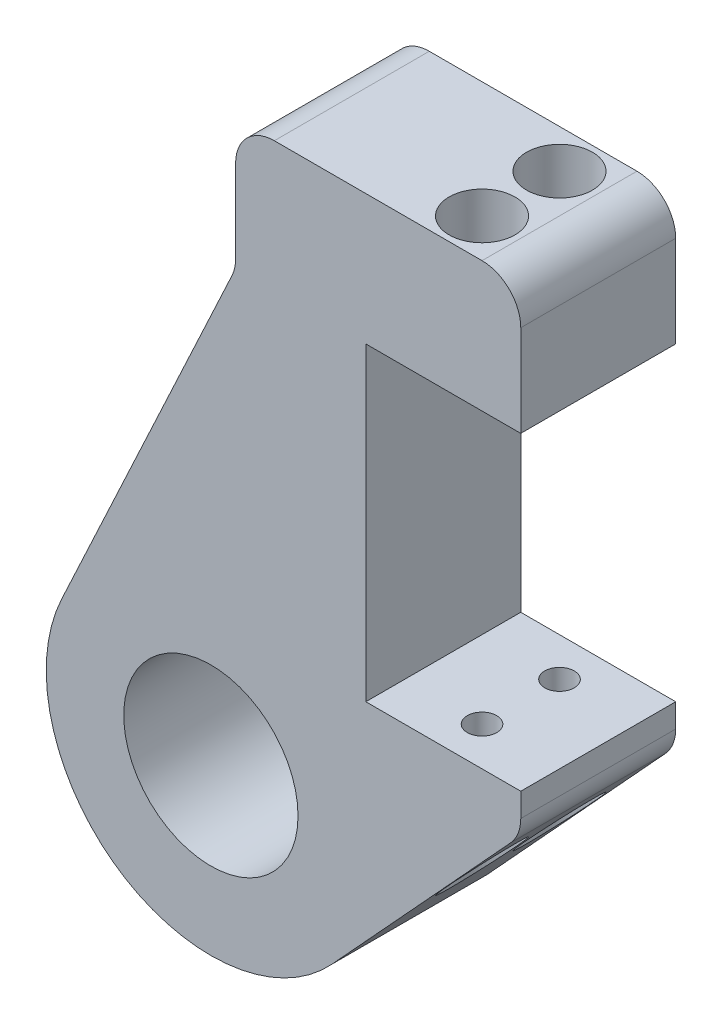
ISO-10303-21;
HEADER;
FILE_DESCRIPTION(('STEP AP214'),'2;1');
FILE_NAME('part.step','',(''),(''),'','','');
FILE_SCHEMA(('AUTOMOTIVE_DESIGN { 1 0 10303 214 1 1 1 1 }'));
ENDSEC;
DATA;
#1=APPLICATION_CONTEXT('core data for automotive mechanical design processes');
#2=APPLICATION_PROTOCOL_DEFINITION('international standard','automotive_design',2000,#1);
#3=PRODUCT_CONTEXT('',#1,'mechanical');
#4=PRODUCT('Part','Part','',(#3));
#5=PRODUCT_RELATED_PRODUCT_CATEGORY('part','',(#4));
#6=PRODUCT_DEFINITION_FORMATION('','',#4);
#7=PRODUCT_DEFINITION_CONTEXT('part definition',#1,'design');
#8=PRODUCT_DEFINITION('design','',#6,#7);
#9=PRODUCT_DEFINITION_SHAPE('','',#8);
#10=(LENGTH_UNIT() NAMED_UNIT(*) SI_UNIT(.MILLI.,.METRE.));
#11=(NAMED_UNIT(*) PLANE_ANGLE_UNIT() SI_UNIT($,.RADIAN.));
#12=(NAMED_UNIT(*) SI_UNIT($,.STERADIAN.) SOLID_ANGLE_UNIT());
#13=UNCERTAINTY_MEASURE_WITH_UNIT(LENGTH_MEASURE(1.E-05),#10,'distance_accuracy_value','');
#14=(GEOMETRIC_REPRESENTATION_CONTEXT(3) GLOBAL_UNCERTAINTY_ASSIGNED_CONTEXT((#13)) GLOBAL_UNIT_ASSIGNED_CONTEXT((#10,
#11,#12)) REPRESENTATION_CONTEXT('',''));
#15=CARTESIAN_POINT('',(0.,0.,0.));
#16=DIRECTION('',(0.,0.,1.));
#17=DIRECTION('',(1.,0.,0.));
#18=AXIS2_PLACEMENT_3D('',#15,#16,#17);
#19=CARTESIAN_POINT('',(-15.8749999999998,-66.7639585918251,812.800000000017));
#20=DIRECTION('',(0.,-1.,0.));
#21=DIRECTION('',(0.,0.,-1.));
#22=AXIS2_PLACEMENT_3D('',#19,#20,#21);
#23=CYLINDRICAL_SURFACE('',#22,2.413);
#24=CARTESIAN_POINT('',(-15.8749999999998,-138.911947917228,812.800000000017));
#25=DIRECTION('',(0.,-1.,0.));
#26=DIRECTION('',(0.,0.,-1.));
#27=AXIS2_PLACEMENT_3D('',#24,#25,#26);
#28=CIRCLE('',#27,2.413);
#29=CARTESIAN_POINT('',(-15.8749999999998,-138.911947917228,810.387000000017));
#30=VERTEX_POINT('',#29);
#31=EDGE_CURVE('E229',#30,#30,#28,.T.);
#32=ORIENTED_EDGE('',*,*,#31,.F.);
#33=EDGE_LOOP('',(#32));
#34=FACE_BOUND('',#33,.T.);
#35=CARTESIAN_POINT('',(-15.8749999999998,-151.611947917228,812.800000000017));
#36=DIRECTION('',(0.,-1.,0.));
#37=DIRECTION('',(0.,0.,-1.));
#38=AXIS2_PLACEMENT_3D('',#35,#36,#37);
#39=CIRCLE('',#38,2.413);
#40=CARTESIAN_POINT('',(-15.8749999999998,-151.611947917228,810.387000000017));
#41=VERTEX_POINT('',#40);
#42=EDGE_CURVE('E236',#41,#41,#39,.F.);
#43=ORIENTED_EDGE('',*,*,#42,.F.);
#44=EDGE_LOOP('',(#43));
#45=FACE_BOUND('',#44,.T.);
#46=ADVANCED_FACE('F43',(#34,#45),#23,.F.);
#47=CARTESIAN_POINT('',(-15.8749999999998,-66.7639585918251,800.100000000017));
#48=DIRECTION('',(0.,-1.,0.));
#49=DIRECTION('',(0.,0.,-1.));
#50=AXIS2_PLACEMENT_3D('',#47,#48,#49);
#51=CYLINDRICAL_SURFACE('',#50,2.413);
#52=CARTESIAN_POINT('',(-15.8749999999998,-138.911947917228,800.100000000017));
#53=DIRECTION('',(0.,-1.,0.));
#54=DIRECTION('',(0.,0.,-1.));
#55=AXIS2_PLACEMENT_3D('',#52,#53,#54);
#56=CIRCLE('',#55,2.413);
#57=CARTESIAN_POINT('',(-15.8749999999998,-138.911947917228,797.687000000017));
#58=VERTEX_POINT('',#57);
#59=EDGE_CURVE('E216',#58,#58,#56,.T.);
#60=ORIENTED_EDGE('',*,*,#59,.F.);
#61=EDGE_LOOP('',(#60));
#62=FACE_BOUND('',#61,.T.);
#63=CARTESIAN_POINT('',(-15.8749999999998,-151.611947917228,800.100000000017));
#64=DIRECTION('',(0.,-1.,0.));
#65=DIRECTION('',(0.,0.,-1.));
#66=AXIS2_PLACEMENT_3D('',#63,#64,#65);
#67=CIRCLE('',#66,2.413);
#68=CARTESIAN_POINT('',(-15.8749999999998,-151.611947917228,797.687000000017));
#69=VERTEX_POINT('',#68);
#70=EDGE_CURVE('E228',#69,#69,#67,.F.);
#71=ORIENTED_EDGE('',*,*,#70,.F.);
#72=EDGE_LOOP('',(#71));
#73=FACE_BOUND('',#72,.T.);
#74=ADVANCED_FACE('F281',(#62,#73),#51,.F.);
#75=CARTESIAN_POINT('',(-53.9750000000132,-160.659378076237,819.150000000017));
#76=DIRECTION('',(0.,0.,1.));
#77=DIRECTION('',(1.,0.,0.));
#78=AXIS2_PLACEMENT_3D('',#75,#76,#77);
#79=PLANE('',#78);
#80=DIRECTION('',(0.676619609693961,0.736332739851755,0.));
#81=VECTOR('',#80,1.);
#82=CARTESIAN_POINT('',(-34.1032201832639,-178.919649792853,819.150000000017));
#83=LINE('',#82,#81);
#84=CARTESIAN_POINT('',(-34.1032201832639,-178.919649792853,819.150000000017));
#85=VERTEX_POINT('',#84);
#86=CARTESIAN_POINT('',(-4.84928710194112,-147.083994442939,819.150000000017));
#87=VERTEX_POINT('',#86);
#88=EDGE_CURVE('E170',#85,#87,#83,.T.);
#89=ORIENTED_EDGE('',*,*,#88,.T.);
#90=CARTESIAN_POINT('',(-9.52499999999979,-142.787459921382,819.150000000017));
#91=DIRECTION('',(0.,0.,1.));
#92=DIRECTION('',(1.,0.,0.));
#93=AXIS2_PLACEMENT_3D('',#90,#91,#92);
#94=CIRCLE('',#93,6.35);
#95=CARTESIAN_POINT('',(-3.17499999999979,-142.787459921382,819.150000000017));
#96=VERTEX_POINT('',#95);
#97=EDGE_CURVE('E252',#87,#96,#94,.T.);
#98=ORIENTED_EDGE('',*,*,#97,.T.);
#99=DIRECTION('',(0.,1.,0.));
#100=VECTOR('',#99,1.);
#101=CARTESIAN_POINT('',(-3.17499999999979,-138.911947917228,819.150000000017));
#102=LINE('',#101,#100);
#103=CARTESIAN_POINT('',(-3.17499999999979,-138.911947917228,819.150000000017));
#104=VERTEX_POINT('',#103);
#105=EDGE_CURVE('E169',#96,#104,#102,.T.);
#106=ORIENTED_EDGE('',*,*,#105,.T.);
#107=DIRECTION('',(-1.,0.,0.));
#108=VECTOR('',#107,1.);
#109=CARTESIAN_POINT('',(-3.17499999999979,-138.911947917228,819.150000000017));
#110=LINE('',#109,#108);
#111=CARTESIAN_POINT('',(-28.5749999999998,-138.911947917228,819.150000000017));
#112=VERTEX_POINT('',#111);
#113=EDGE_CURVE('E172',#104,#112,#110,.T.);
#114=ORIENTED_EDGE('',*,*,#113,.T.);
#115=DIRECTION('',(0.,1.,0.));
#116=VECTOR('',#115,1.);
#117=CARTESIAN_POINT('',(-28.5749999999998,-88.1119479172279,819.150000000017));
#118=LINE('',#117,#116);
#119=CARTESIAN_POINT('',(-28.5749999999998,-88.1119479172279,819.150000000017));
#120=VERTEX_POINT('',#119);
#121=EDGE_CURVE('E176',#112,#120,#118,.T.);
#122=ORIENTED_EDGE('',*,*,#121,.T.);
#123=DIRECTION('',(1.,0.,0.));
#124=VECTOR('',#123,1.);
#125=CARTESIAN_POINT('',(-28.5749999999998,-88.1119479172279,819.150000000017));
#126=LINE('',#125,#124);
#127=CARTESIAN_POINT('',(-3.17499999999979,-88.1119479172279,819.150000000017));
#128=VERTEX_POINT('',#127);
#129=EDGE_CURVE('E178',#120,#128,#126,.T.);
#130=ORIENTED_EDGE('',*,*,#129,.T.);
#131=DIRECTION('',(0.,1.,0.));
#132=VECTOR('',#131,1.);
#133=CARTESIAN_POINT('',(-3.17499999999979,-88.1119479172279,819.150000000017));
#134=LINE('',#133,#132);
#135=CARTESIAN_POINT('',(-3.17499999999979,-73.1139585918251,819.150000000017));
#136=VERTEX_POINT('',#135);
#137=EDGE_CURVE('E204',#128,#136,#134,.T.);
#138=ORIENTED_EDGE('',*,*,#137,.T.);
#139=CARTESIAN_POINT('',(-9.52499999999979,-73.1139585918251,819.150000000017));
#140=DIRECTION('',(0.,0.,1.));
#141=DIRECTION('',(1.,0.,0.));
#142=AXIS2_PLACEMENT_3D('',#139,#140,#141);
#143=CIRCLE('',#142,6.35);
#144=CARTESIAN_POINT('',(-9.52499999999979,-66.7639585918251,819.150000000017));
#145=VERTEX_POINT('',#144);
#146=EDGE_CURVE('E248',#136,#145,#143,.T.);
#147=ORIENTED_EDGE('',*,*,#146,.T.);
#148=DIRECTION('',(-1.,0.,0.));
#149=VECTOR('',#148,1.);
#150=CARTESIAN_POINT('',(-3.17499999999979,-66.7639585918251,819.150000000017));
#151=LINE('',#150,#149);
#152=CARTESIAN_POINT('',(-43.5729893254026,-66.7639585918251,819.150000000017));
#153=VERTEX_POINT('',#152);
#154=EDGE_CURVE('E343',#145,#153,#151,.T.);
#155=ORIENTED_EDGE('',*,*,#154,.T.);
#156=CARTESIAN_POINT('',(-43.5729893254026,-73.1139585918251,819.150000000017));
#157=DIRECTION('',(0.,0.,1.));
#158=DIRECTION('',(1.,0.,0.));
#159=AXIS2_PLACEMENT_3D('',#156,#157,#158);
#160=CIRCLE('',#159,6.35);
#161=CARTESIAN_POINT('',(-49.9229893254026,-73.1139585918251,819.150000000017));
#162=VERTEX_POINT('',#161);
#163=EDGE_CURVE('E250',#153,#162,#160,.T.);
#164=ORIENTED_EDGE('',*,*,#163,.T.);
#165=DIRECTION('',(0.,-1.,0.));
#166=VECTOR('',#165,1.);
#167=CARTESIAN_POINT('',(-49.9229893254026,-88.1119479172279,819.150000000017));
#168=LINE('',#167,#166);
#169=CARTESIAN_POINT('',(-49.9229893254026,-86.7041868094452,819.150000000017));
#170=VERTEX_POINT('',#169);
#171=EDGE_CURVE('E154',#162,#170,#168,.T.);
#172=ORIENTED_EDGE('',*,*,#171,.T.);
#173=CARTESIAN_POINT('',(-56.2729893254026,-86.7041868094452,819.150000000017));
#174=DIRECTION('',(0.,0.,1.));
#175=DIRECTION('',(1.,0.,0.));
#176=AXIS2_PLACEMENT_3D('',#173,#174,#175);
#177=CIRCLE('',#176,6.35);
#178=CARTESIAN_POINT('',(-50.5179348777199,-89.3878127714986,819.150000000017));
#179=VERTEX_POINT('',#178);
#180=EDGE_CURVE('E12',#170,#179,#177,.F.);
#181=ORIENTED_EDGE('',*,*,#180,.T.);
#182=DIRECTION('',(-0.422618261740697,-0.906307787036651,0.));
#183=VECTOR('',#182,1.);
#184=CARTESIAN_POINT('',(-49.9229893254026,-88.1119479172279,819.150000000017));
#185=LINE('',#184,#183);
#186=CARTESIAN_POINT('',(-78.4339814026648,-149.25396773751,819.150000000017));
#187=VERTEX_POINT('',#186);
#188=EDGE_CURVE('E142',#179,#187,#185,.T.);
#189=ORIENTED_EDGE('',*,*,#188,.T.);
#190=CARTESIAN_POINT('',(-53.9750000000132,-160.659378076237,819.150000000017));
#191=DIRECTION('',(0.,0.,1.));
#192=DIRECTION('',(1.,0.,0.));
#193=AXIS2_PLACEMENT_3D('',#190,#191,#192);
#194=CIRCLE('',#193,26.9875);
#195=EDGE_CURVE('E150',#187,#85,#194,.T.);
#196=ORIENTED_EDGE('',*,*,#195,.T.);
#197=EDGE_LOOP('',(#89,#98,#106,#114,#122,#130,#138,#147,#155,#164,#172,#181,#189,#196));
#198=FACE_BOUND('',#197,.T.);
#199=CARTESIAN_POINT('',(-53.9750000000132,-160.659378076237,819.150000000017));
#200=DIRECTION('',(0.,0.,1.));
#201=DIRECTION('',(1.,0.,0.));
#202=AXIS2_PLACEMENT_3D('',#199,#200,#201);
#203=CIRCLE('',#202,14.287500000011);
#204=CARTESIAN_POINT('',(-39.6875000000021,-160.659378076237,819.150000000017));
#205=VERTEX_POINT('',#204);
#206=EDGE_CURVE('E184',#205,#205,#203,.T.);
#207=ORIENTED_EDGE('',*,*,#206,.F.);
#208=EDGE_LOOP('',(#207));
#209=FACE_BOUND('',#208,.T.);
#210=ADVANCED_FACE('F144',(#198,#209),#79,.T.);
#211=CARTESIAN_POINT('',(-53.9750000000132,-160.659378076237,793.750000000017));
#212=DIRECTION('',(0.,0.,1.));
#213=DIRECTION('',(1.,0.,0.));
#214=AXIS2_PLACEMENT_3D('',#211,#212,#213);
#215=PLANE('',#214);
#216=DIRECTION('',(0.,1.,0.));
#217=VECTOR('',#216,1.);
#218=CARTESIAN_POINT('',(-3.17499999999979,-138.911947917228,793.750000000017));
#219=LINE('',#218,#217);
#220=CARTESIAN_POINT('',(-3.17499999999979,-142.787459921382,793.750000000017));
#221=VERTEX_POINT('',#220);
#222=CARTESIAN_POINT('',(-3.17499999999979,-138.911947917228,793.750000000017));
#223=VERTEX_POINT('',#222);
#224=EDGE_CURVE('E198',#221,#223,#219,.T.);
#225=ORIENTED_EDGE('',*,*,#224,.F.);
#226=CARTESIAN_POINT('',(-9.52499999999979,-142.787459921382,793.750000000017));
#227=DIRECTION('',(0.,0.,1.));
#228=DIRECTION('',(1.,0.,0.));
#229=AXIS2_PLACEMENT_3D('',#226,#227,#228);
#230=CIRCLE('',#229,6.35);
#231=CARTESIAN_POINT('',(-4.84928710194112,-147.083994442939,793.750000000017));
#232=VERTEX_POINT('',#231);
#233=EDGE_CURVE('E243',#221,#232,#230,.F.);
#234=ORIENTED_EDGE('',*,*,#233,.T.);
#235=DIRECTION('',(0.676619609693961,0.736332739851755,0.));
#236=VECTOR('',#235,1.);
#237=CARTESIAN_POINT('',(-34.1032201832639,-178.919649792853,793.750000000017));
#238=LINE('',#237,#236);
#239=CARTESIAN_POINT('',(-34.1032201832639,-178.919649792853,793.750000000017));
#240=VERTEX_POINT('',#239);
#241=EDGE_CURVE('E192',#240,#232,#238,.T.);
#242=ORIENTED_EDGE('',*,*,#241,.F.);
#243=CARTESIAN_POINT('',(-53.9750000000132,-160.659378076237,793.750000000017));
#244=DIRECTION('',(0.,0.,1.));
#245=DIRECTION('',(1.,0.,0.));
#246=AXIS2_PLACEMENT_3D('',#243,#244,#245);
#247=CIRCLE('',#246,26.9875);
#248=CARTESIAN_POINT('',(-78.4339814026648,-149.25396773751,793.750000000017));
#249=VERTEX_POINT('',#248);
#250=EDGE_CURVE('E191',#249,#240,#247,.T.);
#251=ORIENTED_EDGE('',*,*,#250,.F.);
#252=DIRECTION('',(-0.422618261740697,-0.906307787036651,0.));
#253=VECTOR('',#252,1.);
#254=CARTESIAN_POINT('',(-49.9229893254026,-88.1119479172279,793.750000000017));
#255=LINE('',#254,#253);
#256=CARTESIAN_POINT('',(-50.5179348777199,-89.3878127714986,793.750000000017));
#257=VERTEX_POINT('',#256);
#258=EDGE_CURVE('E156',#257,#249,#255,.T.);
#259=ORIENTED_EDGE('',*,*,#258,.F.);
#260=CARTESIAN_POINT('',(-56.2729893254026,-86.7041868094452,793.750000000017));
#261=DIRECTION('',(0.,0.,1.));
#262=DIRECTION('',(1.,0.,0.));
#263=AXIS2_PLACEMENT_3D('',#260,#261,#262);
#264=CIRCLE('',#263,6.35);
#265=CARTESIAN_POINT('',(-49.9229893254026,-86.7041868094452,793.750000000017));
#266=VERTEX_POINT('',#265);
#267=EDGE_CURVE('E51',#257,#266,#264,.T.);
#268=ORIENTED_EDGE('',*,*,#267,.T.);
#269=DIRECTION('',(0.,-1.,0.));
#270=VECTOR('',#269,1.);
#271=CARTESIAN_POINT('',(-49.9229893254026,-88.1119479172279,793.750000000017));
#272=LINE('',#271,#270);
#273=CARTESIAN_POINT('',(-49.9229893254026,-73.1139585918251,793.750000000017));
#274=VERTEX_POINT('',#273);
#275=EDGE_CURVE('E189',#274,#266,#272,.T.);
#276=ORIENTED_EDGE('',*,*,#275,.F.);
#277=CARTESIAN_POINT('',(-43.5729893254026,-73.1139585918251,793.750000000017));
#278=DIRECTION('',(0.,0.,1.));
#279=DIRECTION('',(1.,0.,0.));
#280=AXIS2_PLACEMENT_3D('',#277,#278,#279);
#281=CIRCLE('',#280,6.35);
#282=CARTESIAN_POINT('',(-43.5729893254026,-66.7639585918251,793.750000000017));
#283=VERTEX_POINT('',#282);
#284=EDGE_CURVE('E237',#274,#283,#281,.F.);
#285=ORIENTED_EDGE('',*,*,#284,.T.);
#286=DIRECTION('',(-1.,0.,0.));
#287=VECTOR('',#286,1.);
#288=CARTESIAN_POINT('',(-3.17499999999979,-66.7639585918251,793.750000000017));
#289=LINE('',#288,#287);
#290=CARTESIAN_POINT('',(-9.52499999999979,-66.7639585918251,793.750000000017));
#291=VERTEX_POINT('',#290);
#292=EDGE_CURVE('E183',#291,#283,#289,.T.);
#293=ORIENTED_EDGE('',*,*,#292,.F.);
#294=CARTESIAN_POINT('',(-9.52499999999979,-73.1139585918251,793.750000000017));
#295=DIRECTION('',(0.,0.,1.));
#296=DIRECTION('',(1.,0.,0.));
#297=AXIS2_PLACEMENT_3D('',#294,#295,#296);
#298=CIRCLE('',#297,6.35);
#299=CARTESIAN_POINT('',(-3.17499999999979,-73.1139585918251,793.750000000017));
#300=VERTEX_POINT('',#299);
#301=EDGE_CURVE('E241',#291,#300,#298,.F.);
#302=ORIENTED_EDGE('',*,*,#301,.T.);
#303=DIRECTION('',(0.,1.,0.));
#304=VECTOR('',#303,1.);
#305=CARTESIAN_POINT('',(-3.17499999999979,-88.1119479172279,793.750000000017));
#306=LINE('',#305,#304);
#307=CARTESIAN_POINT('',(-3.17499999999979,-88.1119479172279,793.750000000017));
#308=VERTEX_POINT('',#307);
#309=EDGE_CURVE('E181',#308,#300,#306,.T.);
#310=ORIENTED_EDGE('',*,*,#309,.F.);
#311=DIRECTION('',(1.,0.,0.));
#312=VECTOR('',#311,1.);
#313=CARTESIAN_POINT('',(-28.5749999999998,-88.1119479172279,793.750000000017));
#314=LINE('',#313,#312);
#315=CARTESIAN_POINT('',(-28.5749999999998,-88.1119479172279,793.750000000017));
#316=VERTEX_POINT('',#315);
#317=EDGE_CURVE('E205',#316,#308,#314,.T.);
#318=ORIENTED_EDGE('',*,*,#317,.F.);
#319=DIRECTION('',(0.,1.,0.));
#320=VECTOR('',#319,1.);
#321=CARTESIAN_POINT('',(-28.5749999999998,-88.1119479172279,793.750000000017));
#322=LINE('',#321,#320);
#323=CARTESIAN_POINT('',(-28.5749999999998,-138.911947917228,793.750000000017));
#324=VERTEX_POINT('',#323);
#325=EDGE_CURVE('E196',#324,#316,#322,.T.);
#326=ORIENTED_EDGE('',*,*,#325,.F.);
#327=DIRECTION('',(-1.,0.,0.));
#328=VECTOR('',#327,1.);
#329=CARTESIAN_POINT('',(-3.17499999999979,-138.911947917228,793.750000000017));
#330=LINE('',#329,#328);
#331=EDGE_CURVE('E197',#223,#324,#330,.T.);
#332=ORIENTED_EDGE('',*,*,#331,.F.);
#333=EDGE_LOOP('',(#225,#234,#242,#251,#259,#268,#276,#285,#293,#302,#310,#318,#326,#332));
#334=FACE_BOUND('',#333,.T.);
#335=CARTESIAN_POINT('',(-53.9750000000132,-160.659378076237,793.750000000017));
#336=DIRECTION('',(0.,0.,1.));
#337=DIRECTION('',(1.,0.,0.));
#338=AXIS2_PLACEMENT_3D('',#335,#336,#337);
#339=CIRCLE('',#338,14.287500000011);
#340=CARTESIAN_POINT('',(-39.6875000000021,-160.659378076237,793.750000000017));
#341=VERTEX_POINT('',#340);
#342=EDGE_CURVE('E350',#341,#341,#339,.T.);
#343=ORIENTED_EDGE('',*,*,#342,.T.);
#344=EDGE_LOOP('',(#343));
#345=FACE_BOUND('',#344,.T.);
#346=ADVANCED_FACE('F266',(#334,#345),#215,.F.);
#347=CARTESIAN_POINT('',(-3.17499999999979,-88.1119479172279,819.150000000017));
#348=DIRECTION('',(-1.,0.,0.));
#349=DIRECTION('',(0.,0.,1.));
#350=AXIS2_PLACEMENT_3D('',#347,#348,#349);
#351=PLANE('',#350);
#352=ORIENTED_EDGE('',*,*,#309,.T.);
#353=DIRECTION('',(0.,0.,-1.));
#354=VECTOR('',#353,1.);
#355=CARTESIAN_POINT('',(-3.17499999999979,-73.1139585918251,819.150000000017));
#356=LINE('',#355,#354);
#357=EDGE_CURVE('E257',#300,#136,#356,.F.);
#358=ORIENTED_EDGE('',*,*,#357,.T.);
#359=ORIENTED_EDGE('',*,*,#137,.F.);
#360=DIRECTION('',(0.,0.,-1.));
#361=VECTOR('',#360,1.);
#362=CARTESIAN_POINT('',(-3.17499999999979,-88.1119479172279,819.150000000017));
#363=LINE('',#362,#361);
#364=EDGE_CURVE('E179',#128,#308,#363,.T.);
#365=ORIENTED_EDGE('',*,*,#364,.T.);
#366=EDGE_LOOP('',(#352,#358,#359,#365));
#367=FACE_BOUND('',#366,.T.);
#368=ADVANCED_FACE('F331',(#367),#351,.F.);
#369=CARTESIAN_POINT('',(-3.17499999999979,-66.7639585918251,819.150000000017));
#370=DIRECTION('',(0.,-1.,0.));
#371=DIRECTION('',(0.,0.,-1.));
#372=AXIS2_PLACEMENT_3D('',#369,#370,#371);
#373=PLANE('',#372);
#374=CARTESIAN_POINT('',(-15.8749999999998,-66.7639585918251,812.800000000017));
#375=DIRECTION('',(0.,-1.,0.));
#376=DIRECTION('',(0.,0.,-1.));
#377=AXIS2_PLACEMENT_3D('',#374,#375,#376);
#378=CIRCLE('',#377,5.39749999999999);
#379=CARTESIAN_POINT('',(-15.8749999999998,-66.7639585918251,807.402500000017));
#380=VERTEX_POINT('',#379);
#381=EDGE_CURVE('E233',#380,#380,#378,.T.);
#382=ORIENTED_EDGE('',*,*,#381,.T.);
#383=EDGE_LOOP('',(#382));
#384=FACE_BOUND('',#383,.T.);
#385=CARTESIAN_POINT('',(-15.8749999999998,-66.7639585918251,800.100000000017));
#386=DIRECTION('',(0.,-1.,0.));
#387=DIRECTION('',(0.,0.,-1.));
#388=AXIS2_PLACEMENT_3D('',#385,#386,#387);
#389=CIRCLE('',#388,5.39749999999999);
#390=CARTESIAN_POINT('',(-15.8749999999998,-66.7639585918251,794.702500000017));
#391=VERTEX_POINT('',#390);
#392=EDGE_CURVE('E223',#391,#391,#389,.T.);
#393=ORIENTED_EDGE('',*,*,#392,.T.);
#394=EDGE_LOOP('',(#393));
#395=FACE_BOUND('',#394,.T.);
#396=ORIENTED_EDGE('',*,*,#154,.F.);
#397=DIRECTION('',(0.,0.,-1.));
#398=VECTOR('',#397,1.);
#399=CARTESIAN_POINT('',(-9.52499999999979,-66.7639585918251,819.150000000017));
#400=LINE('',#399,#398);
#401=EDGE_CURVE('E253',#145,#291,#400,.T.);
#402=ORIENTED_EDGE('',*,*,#401,.T.);
#403=ORIENTED_EDGE('',*,*,#292,.T.);
#404=DIRECTION('',(0.,0.,-1.));
#405=VECTOR('',#404,1.);
#406=CARTESIAN_POINT('',(-43.5729893254026,-66.7639585918251,819.150000000017));
#407=LINE('',#406,#405);
#408=EDGE_CURVE('E254',#283,#153,#407,.F.);
#409=ORIENTED_EDGE('',*,*,#408,.T.);
#410=EDGE_LOOP('',(#396,#402,#403,#409));
#411=FACE_BOUND('',#410,.T.);
#412=ADVANCED_FACE('F341',(#384,#395,#411),#373,.F.);
#413=CARTESIAN_POINT('',(-49.9229893254026,-88.1119479172279,819.150000000017));
#414=DIRECTION('',(1.,0.,0.));
#415=DIRECTION('',(0.,1.,0.));
#416=AXIS2_PLACEMENT_3D('',#413,#414,#415);
#417=PLANE('',#416);
#418=ORIENTED_EDGE('',*,*,#275,.T.);
#419=DIRECTION('',(0.,0.,-1.));
#420=VECTOR('',#419,1.);
#421=CARTESIAN_POINT('',(-49.9229893254026,-86.7041868094452,819.150000000017));
#422=LINE('',#421,#420);
#423=EDGE_CURVE('E63',#266,#170,#422,.F.);
#424=ORIENTED_EDGE('',*,*,#423,.T.);
#425=ORIENTED_EDGE('',*,*,#171,.F.);
#426=DIRECTION('',(0.,0.,-1.));
#427=VECTOR('',#426,1.);
#428=CARTESIAN_POINT('',(-49.9229893254026,-73.1139585918251,819.150000000017));
#429=LINE('',#428,#427);
#430=EDGE_CURVE('E264',#162,#274,#429,.T.);
#431=ORIENTED_EDGE('',*,*,#430,.T.);
#432=EDGE_LOOP('',(#418,#424,#425,#431));
#433=FACE_BOUND('',#432,.T.);
#434=ADVANCED_FACE('F272',(#433),#417,.F.);
#435=CARTESIAN_POINT('',(-49.9229893254026,-88.1119479172279,819.150000000017));
#436=DIRECTION('',(0.906307787036651,-0.422618261740697,0.));
#437=DIRECTION('',(0.422618261740697,0.906307787036651,0.));
#438=AXIS2_PLACEMENT_3D('',#435,#436,#437);
#439=PLANE('',#438);
#440=ORIENTED_EDGE('',*,*,#188,.F.);
#441=DIRECTION('',(0.,0.,-1.));
#442=VECTOR('',#441,1.);
#443=CARTESIAN_POINT('',(-50.5179348777199,-89.3878127714986,793.750000000017));
#444=LINE('',#443,#442);
#445=EDGE_CURVE('E259',#179,#257,#444,.T.);
#446=ORIENTED_EDGE('',*,*,#445,.T.);
#447=ORIENTED_EDGE('',*,*,#258,.T.);
#448=DIRECTION('',(0.,0.,-1.));
#449=VECTOR('',#448,1.);
#450=CARTESIAN_POINT('',(-78.4339814026648,-149.25396773751,819.150000000017));
#451=LINE('',#450,#449);
#452=EDGE_CURVE('E151',#187,#249,#451,.T.);
#453=ORIENTED_EDGE('',*,*,#452,.F.);
#454=EDGE_LOOP('',(#440,#446,#447,#453));
#455=FACE_BOUND('',#454,.T.);
#456=ADVANCED_FACE('F158',(#455),#439,.F.);
#457=CARTESIAN_POINT('',(-53.9750000000132,-160.659378076237,819.150000000017));
#458=DIRECTION('',(0.,0.,-1.));
#459=DIRECTION('',(-1.,0.,0.));
#460=AXIS2_PLACEMENT_3D('',#457,#458,#459);
#461=CYLINDRICAL_SURFACE('',#460,26.9875);
#462=ORIENTED_EDGE('',*,*,#250,.T.);
#463=DIRECTION('',(0.,0.,-1.));
#464=VECTOR('',#463,1.);
#465=CARTESIAN_POINT('',(-34.1032201832639,-178.919649792853,819.150000000017));
#466=LINE('',#465,#464);
#467=EDGE_CURVE('E162',#85,#240,#466,.T.);
#468=ORIENTED_EDGE('',*,*,#467,.F.);
#469=ORIENTED_EDGE('',*,*,#195,.F.);
#470=ORIENTED_EDGE('',*,*,#452,.T.);
#471=EDGE_LOOP('',(#462,#468,#469,#470));
#472=FACE_BOUND('',#471,.T.);
#473=ADVANCED_FACE('F165',(#472),#461,.T.);
#474=CARTESIAN_POINT('',(-34.1032201832639,-178.919649792853,819.150000000017));
#475=DIRECTION('',(-0.736332739851755,0.676619609693961,0.));
#476=DIRECTION('',(-0.676619609693961,-0.736332739851755,0.));
#477=AXIS2_PLACEMENT_3D('',#474,#475,#476);
#478=PLANE('',#477);
#479=CARTESIAN_POINT('',(-15.8749999999998,-159.082750125942,812.800000000017));
#480=DIRECTION('',(-0.736332739851755,0.676619609693961,0.));
#481=DIRECTION('',(-0.676619609693961,-0.736332739851755,0.));
#482=AXIS2_PLACEMENT_3D('',#479,#480,#481);
#483=ELLIPSE('',#482,7.97715573517197,5.39749999999999);
#484=CARTESIAN_POINT('',(-21.2724999999998,-164.956591064645,812.800000000017));
#485=VERTEX_POINT('',#484);
#486=EDGE_CURVE('E235',#485,#485,#483,.T.);
#487=ORIENTED_EDGE('',*,*,#486,.T.);
#488=EDGE_LOOP('',(#487));
#489=FACE_BOUND('',#488,.T.);
#490=CARTESIAN_POINT('',(-15.8749999999998,-159.082750125942,800.100000000017));
#491=DIRECTION('',(-0.736332739851755,0.676619609693961,0.));
#492=DIRECTION('',(-0.676619609693961,-0.736332739851755,0.));
#493=AXIS2_PLACEMENT_3D('',#490,#491,#492);
#494=ELLIPSE('',#493,7.97715573517197,5.39749999999999);
#495=CARTESIAN_POINT('',(-21.2724999999998,-164.956591064645,800.100000000017));
#496=VERTEX_POINT('',#495);
#497=EDGE_CURVE('E225',#496,#496,#494,.T.);
#498=ORIENTED_EDGE('',*,*,#497,.T.);
#499=EDGE_LOOP('',(#498));
#500=FACE_BOUND('',#499,.T.);
#501=ORIENTED_EDGE('',*,*,#241,.T.);
#502=DIRECTION('',(0.,0.,-1.));
#503=VECTOR('',#502,1.);
#504=CARTESIAN_POINT('',(-4.84928710194113,-147.083994442939,819.150000000017));
#505=LINE('',#504,#503);
#506=EDGE_CURVE('E244',#232,#87,#505,.F.);
#507=ORIENTED_EDGE('',*,*,#506,.T.);
#508=ORIENTED_EDGE('',*,*,#88,.F.);
#509=ORIENTED_EDGE('',*,*,#467,.T.);
#510=EDGE_LOOP('',(#501,#507,#508,#509));
#511=FACE_BOUND('',#510,.T.);
#512=ADVANCED_FACE('F455',(#489,#500,#511),#478,.F.);
#513=CARTESIAN_POINT('',(-3.17499999999979,-138.911947917228,819.150000000017));
#514=DIRECTION('',(-1.,0.,0.));
#515=DIRECTION('',(0.,-1.,0.));
#516=AXIS2_PLACEMENT_3D('',#513,#514,#515);
#517=PLANE('',#516);
#518=ORIENTED_EDGE('',*,*,#105,.F.);
#519=DIRECTION('',(0.,0.,-1.));
#520=VECTOR('',#519,1.);
#521=CARTESIAN_POINT('',(-3.17499999999979,-142.787459921382,819.150000000017));
#522=LINE('',#521,#520);
#523=EDGE_CURVE('E163',#96,#221,#522,.T.);
#524=ORIENTED_EDGE('',*,*,#523,.T.);
#525=ORIENTED_EDGE('',*,*,#224,.T.);
#526=DIRECTION('',(0.,0.,-1.));
#527=VECTOR('',#526,1.);
#528=CARTESIAN_POINT('',(-3.17499999999979,-138.911947917228,819.150000000017));
#529=LINE('',#528,#527);
#530=EDGE_CURVE('E212',#104,#223,#529,.T.);
#531=ORIENTED_EDGE('',*,*,#530,.F.);
#532=EDGE_LOOP('',(#518,#524,#525,#531));
#533=FACE_BOUND('',#532,.T.);
#534=ADVANCED_FACE('F450',(#533),#517,.F.);
#535=CARTESIAN_POINT('',(-3.17499999999979,-138.911947917228,819.150000000017));
#536=DIRECTION('',(0.,-1.,0.));
#537=DIRECTION('',(0.,0.,-1.));
#538=AXIS2_PLACEMENT_3D('',#535,#536,#537);
#539=PLANE('',#538);
#540=ORIENTED_EDGE('',*,*,#31,.T.);
#541=EDGE_LOOP('',(#540));
#542=FACE_BOUND('',#541,.T.);
#543=ORIENTED_EDGE('',*,*,#59,.T.);
#544=EDGE_LOOP('',(#543));
#545=FACE_BOUND('',#544,.T.);
#546=ORIENTED_EDGE('',*,*,#331,.T.);
#547=DIRECTION('',(0.,0.,-1.));
#548=VECTOR('',#547,1.);
#549=CARTESIAN_POINT('',(-28.5749999999998,-138.911947917228,819.150000000017));
#550=LINE('',#549,#548);
#551=EDGE_CURVE('E208',#112,#324,#550,.T.);
#552=ORIENTED_EDGE('',*,*,#551,.F.);
#553=ORIENTED_EDGE('',*,*,#113,.F.);
#554=ORIENTED_EDGE('',*,*,#530,.T.);
#555=EDGE_LOOP('',(#546,#552,#553,#554));
#556=FACE_BOUND('',#555,.T.);
#557=ADVANCED_FACE('F451',(#542,#545,#556),#539,.F.);
#558=CARTESIAN_POINT('',(-28.5749999999998,-88.1119479172279,819.150000000017));
#559=DIRECTION('',(-1.,0.,0.));
#560=DIRECTION('',(0.,-1.,0.));
#561=AXIS2_PLACEMENT_3D('',#558,#559,#560);
#562=PLANE('',#561);
#563=ORIENTED_EDGE('',*,*,#325,.T.);
#564=DIRECTION('',(0.,0.,-1.));
#565=VECTOR('',#564,1.);
#566=CARTESIAN_POINT('',(-28.5749999999998,-88.1119479172279,819.150000000017));
#567=LINE('',#566,#565);
#568=EDGE_CURVE('E210',#120,#316,#567,.T.);
#569=ORIENTED_EDGE('',*,*,#568,.F.);
#570=ORIENTED_EDGE('',*,*,#121,.F.);
#571=ORIENTED_EDGE('',*,*,#551,.T.);
#572=EDGE_LOOP('',(#563,#569,#570,#571));
#573=FACE_BOUND('',#572,.T.);
#574=ADVANCED_FACE('F321',(#573),#562,.F.);
#575=CARTESIAN_POINT('',(-28.5749999999998,-88.1119479172279,819.150000000017));
#576=DIRECTION('',(0.,1.,0.));
#577=DIRECTION('',(0.,0.,1.));
#578=AXIS2_PLACEMENT_3D('',#575,#576,#577);
#579=PLANE('',#578);
#580=CARTESIAN_POINT('',(-15.8749999999998,-88.1119479172279,812.800000000017));
#581=DIRECTION('',(0.,1.,0.));
#582=DIRECTION('',(0.,0.,1.));
#583=AXIS2_PLACEMENT_3D('',#580,#581,#582);
#584=CIRCLE('',#583,2.413);
#585=CARTESIAN_POINT('',(-15.8749999999998,-88.1119479172279,815.213000000017));
#586=VERTEX_POINT('',#585);
#587=EDGE_CURVE('E227',#586,#586,#584,.T.);
#588=ORIENTED_EDGE('',*,*,#587,.T.);
#589=EDGE_LOOP('',(#588));
#590=FACE_BOUND('',#589,.T.);
#591=CARTESIAN_POINT('',(-15.8749999999998,-88.1119479172279,800.100000000017));
#592=DIRECTION('',(0.,1.,0.));
#593=DIRECTION('',(0.,0.,1.));
#594=AXIS2_PLACEMENT_3D('',#591,#592,#593);
#595=CIRCLE('',#594,2.413);
#596=CARTESIAN_POINT('',(-15.8749999999998,-88.1119479172279,802.513000000017));
#597=VERTEX_POINT('',#596);
#598=EDGE_CURVE('E219',#597,#597,#595,.T.);
#599=ORIENTED_EDGE('',*,*,#598,.T.);
#600=EDGE_LOOP('',(#599));
#601=FACE_BOUND('',#600,.T.);
#602=ORIENTED_EDGE('',*,*,#317,.T.);
#603=ORIENTED_EDGE('',*,*,#364,.F.);
#604=ORIENTED_EDGE('',*,*,#129,.F.);
#605=ORIENTED_EDGE('',*,*,#568,.T.);
#606=EDGE_LOOP('',(#602,#603,#604,#605));
#607=FACE_BOUND('',#606,.T.);
#608=ADVANCED_FACE('F319',(#590,#601,#607),#579,.F.);
#609=CARTESIAN_POINT('',(-53.9750000000132,-160.659378076237,819.150000000017));
#610=DIRECTION('',(0.,0.,-1.));
#611=DIRECTION('',(-1.,0.,0.));
#612=AXIS2_PLACEMENT_3D('',#609,#610,#611);
#613=CYLINDRICAL_SURFACE('',#612,14.287500000011);
#614=ORIENTED_EDGE('',*,*,#206,.T.);
#615=EDGE_LOOP('',(#614));
#616=FACE_BOUND('',#615,.T.);
#617=ORIENTED_EDGE('',*,*,#342,.F.);
#618=EDGE_LOOP('',(#617));
#619=FACE_BOUND('',#618,.T.);
#620=ADVANCED_FACE('F318',(#616,#619),#613,.F.);
#621=CARTESIAN_POINT('',(-15.8749999999998,-75.4119479172279,800.100000000017));
#622=DIRECTION('',(0.,-1.,0.));
#623=DIRECTION('',(0.,0.,-1.));
#624=AXIS2_PLACEMENT_3D('',#621,#622,#623);
#625=CIRCLE('',#624,2.413);
#626=CARTESIAN_POINT('',(-15.8749999999998,-75.4119479172279,797.687000000017));
#627=VERTEX_POINT('',#626);
#628=EDGE_CURVE('E222',#627,#627,#625,.T.);
#629=ORIENTED_EDGE('',*,*,#628,.F.);
#630=EDGE_LOOP('',(#629));
#631=FACE_BOUND('',#630,.T.);
#632=ORIENTED_EDGE('',*,*,#598,.F.);
#633=EDGE_LOOP('',(#632));
#634=FACE_BOUND('',#633,.T.);
#635=ADVANCED_FACE('F298',(#631,#634),#51,.F.);
#636=CARTESIAN_POINT('',(-15.8749999999998,-66.7639585918251,800.100000000017));
#637=DIRECTION('',(0.,-1.,0.));
#638=DIRECTION('',(0.,0.,-1.));
#639=AXIS2_PLACEMENT_3D('',#636,#637,#638);
#640=CYLINDRICAL_SURFACE('',#639,5.39749999999999);
#641=ORIENTED_EDGE('',*,*,#392,.F.);
#642=EDGE_LOOP('',(#641));
#643=FACE_BOUND('',#642,.T.);
#644=CARTESIAN_POINT('',(-15.8749999999998,-75.4119479172279,800.100000000017));
#645=DIRECTION('',(0.,-1.,0.));
#646=DIRECTION('',(0.,0.,-1.));
#647=AXIS2_PLACEMENT_3D('',#644,#645,#646);
#648=CIRCLE('',#647,5.39749999999999);
#649=CARTESIAN_POINT('',(-15.8749999999998,-75.4119479172279,794.702500000017));
#650=VERTEX_POINT('',#649);
#651=EDGE_CURVE('E358',#650,#650,#648,.T.);
#652=ORIENTED_EDGE('',*,*,#651,.T.);
#653=EDGE_LOOP('',(#652));
#654=FACE_BOUND('',#653,.T.);
#655=ADVANCED_FACE('F554',(#643,#654),#640,.F.);
#656=CARTESIAN_POINT('',(-15.8749999999998,-75.4119479172279,800.100000000017));
#657=DIRECTION('',(0.,-1.,0.));
#658=DIRECTION('',(0.,0.,-1.));
#659=AXIS2_PLACEMENT_3D('',#656,#657,#658);
#660=PLANE('',#659);
#661=ORIENTED_EDGE('',*,*,#628,.T.);
#662=EDGE_LOOP('',(#661));
#663=FACE_BOUND('',#662,.T.);
#664=ORIENTED_EDGE('',*,*,#651,.F.);
#665=EDGE_LOOP('',(#664));
#666=FACE_BOUND('',#665,.T.);
#667=ADVANCED_FACE('F563',(#663,#666),#660,.F.);
#668=CARTESIAN_POINT('',(-15.8749999999998,-123.64551251141,800.100000000017));
#669=DIRECTION('',(0.,-1.,0.));
#670=DIRECTION('',(0.,0.,-1.));
#671=AXIS2_PLACEMENT_3D('',#668,#669,#670);
#672=CYLINDRICAL_SURFACE('',#671,5.39749999999999);
#673=CARTESIAN_POINT('',(-15.8749999999998,-151.611947917228,800.100000000017));
#674=DIRECTION('',(0.,-1.,0.));
#675=DIRECTION('',(0.,0.,-1.));
#676=AXIS2_PLACEMENT_3D('',#673,#674,#675);
#677=CIRCLE('',#676,5.39749999999999);
#678=CARTESIAN_POINT('',(-15.8749999999998,-151.611947917228,794.702500000017));
#679=VERTEX_POINT('',#678);
#680=EDGE_CURVE('E362',#679,#679,#677,.F.);
#681=ORIENTED_EDGE('',*,*,#680,.T.);
#682=EDGE_LOOP('',(#681));
#683=FACE_BOUND('',#682,.T.);
#684=ORIENTED_EDGE('',*,*,#497,.F.);
#685=EDGE_LOOP('',(#684));
#686=FACE_BOUND('',#685,.T.);
#687=ADVANCED_FACE('F311',(#683,#686),#672,.F.);
#688=CARTESIAN_POINT('',(-3.17499999999979,-151.611947917228,819.150000000017));
#689=DIRECTION('',(0.,-1.,0.));
#690=DIRECTION('',(0.,0.,-1.));
#691=AXIS2_PLACEMENT_3D('',#688,#689,#690);
#692=PLANE('',#691);
#693=ORIENTED_EDGE('',*,*,#680,.F.);
#694=EDGE_LOOP('',(#693));
#695=FACE_BOUND('',#694,.T.);
#696=ORIENTED_EDGE('',*,*,#70,.T.);
#697=EDGE_LOOP('',(#696));
#698=FACE_BOUND('',#697,.T.);
#699=ADVANCED_FACE('F303',(#695,#698),#692,.T.);
#700=CARTESIAN_POINT('',(-15.8749999999998,-75.4119479172279,812.800000000017));
#701=DIRECTION('',(0.,-1.,0.));
#702=DIRECTION('',(0.,0.,-1.));
#703=AXIS2_PLACEMENT_3D('',#700,#701,#702);
#704=CIRCLE('',#703,2.413);
#705=CARTESIAN_POINT('',(-15.8749999999998,-75.4119479172279,810.387000000017));
#706=VERTEX_POINT('',#705);
#707=EDGE_CURVE('E232',#706,#706,#704,.T.);
#708=ORIENTED_EDGE('',*,*,#707,.F.);
#709=EDGE_LOOP('',(#708));
#710=FACE_BOUND('',#709,.T.);
#711=ORIENTED_EDGE('',*,*,#587,.F.);
#712=EDGE_LOOP('',(#711));
#713=FACE_BOUND('',#712,.T.);
#714=ADVANCED_FACE('F286',(#710,#713),#23,.F.);
#715=CARTESIAN_POINT('',(-15.8749999999998,-66.7639585918251,812.800000000017));
#716=DIRECTION('',(0.,-1.,0.));
#717=DIRECTION('',(0.,0.,-1.));
#718=AXIS2_PLACEMENT_3D('',#715,#716,#717);
#719=CYLINDRICAL_SURFACE('',#718,5.39749999999999);
#720=ORIENTED_EDGE('',*,*,#381,.F.);
#721=EDGE_LOOP('',(#720));
#722=FACE_BOUND('',#721,.T.);
#723=CARTESIAN_POINT('',(-15.8749999999998,-75.4119479172279,812.800000000017));
#724=DIRECTION('',(0.,-1.,0.));
#725=DIRECTION('',(0.,0.,-1.));
#726=AXIS2_PLACEMENT_3D('',#723,#724,#725);
#727=CIRCLE('',#726,5.39749999999999);
#728=CARTESIAN_POINT('',(-15.8749999999998,-75.4119479172279,807.402500000017));
#729=VERTEX_POINT('',#728);
#730=EDGE_CURVE('E369',#729,#729,#727,.T.);
#731=ORIENTED_EDGE('',*,*,#730,.T.);
#732=EDGE_LOOP('',(#731));
#733=FACE_BOUND('',#732,.T.);
#734=ADVANCED_FACE('F305',(#722,#733),#719,.F.);
#735=CARTESIAN_POINT('',(-15.8749999999998,-75.4119479172279,812.800000000017));
#736=DIRECTION('',(0.,-1.,0.));
#737=DIRECTION('',(0.,0.,-1.));
#738=AXIS2_PLACEMENT_3D('',#735,#736,#737);
#739=PLANE('',#738);
#740=ORIENTED_EDGE('',*,*,#707,.T.);
#741=EDGE_LOOP('',(#740));
#742=FACE_BOUND('',#741,.T.);
#743=ORIENTED_EDGE('',*,*,#730,.F.);
#744=EDGE_LOOP('',(#743));
#745=FACE_BOUND('',#744,.T.);
#746=ADVANCED_FACE('F307',(#742,#745),#739,.F.);
#747=CARTESIAN_POINT('',(-15.8749999999998,-123.64551251141,812.800000000017));
#748=DIRECTION('',(0.,-1.,0.));
#749=DIRECTION('',(0.,0.,-1.));
#750=AXIS2_PLACEMENT_3D('',#747,#748,#749);
#751=CYLINDRICAL_SURFACE('',#750,5.39749999999999);
#752=CARTESIAN_POINT('',(-15.8749999999998,-151.611947917228,812.800000000017));
#753=DIRECTION('',(0.,-1.,0.));
#754=DIRECTION('',(0.,0.,-1.));
#755=AXIS2_PLACEMENT_3D('',#752,#753,#754);
#756=CIRCLE('',#755,5.39749999999999);
#757=CARTESIAN_POINT('',(-15.8749999999998,-151.611947917228,807.402500000017));
#758=VERTEX_POINT('',#757);
#759=EDGE_CURVE('E377',#758,#758,#756,.F.);
#760=ORIENTED_EDGE('',*,*,#759,.T.);
#761=EDGE_LOOP('',(#760));
#762=FACE_BOUND('',#761,.T.);
#763=ORIENTED_EDGE('',*,*,#486,.F.);
#764=EDGE_LOOP('',(#763));
#765=FACE_BOUND('',#764,.T.);
#766=ADVANCED_FACE('F385',(#762,#765),#751,.F.);
#767=CARTESIAN_POINT('',(-3.17499999999979,-151.611947917228,819.150000000017));
#768=DIRECTION('',(0.,-1.,0.));
#769=DIRECTION('',(0.,0.,-1.));
#770=AXIS2_PLACEMENT_3D('',#767,#768,#769);
#771=PLANE('',#770);
#772=ORIENTED_EDGE('',*,*,#759,.F.);
#773=EDGE_LOOP('',(#772));
#774=FACE_BOUND('',#773,.T.);
#775=ORIENTED_EDGE('',*,*,#42,.T.);
#776=EDGE_LOOP('',(#775));
#777=FACE_BOUND('',#776,.T.);
#778=ADVANCED_FACE('F383',(#774,#777),#771,.T.);
#779=CARTESIAN_POINT('',(-9.52499999999979,-142.787459921382,819.150000000017));
#780=DIRECTION('',(0.,0.,-1.));
#781=DIRECTION('',(-1.,0.,0.));
#782=AXIS2_PLACEMENT_3D('',#779,#780,#781);
#783=CYLINDRICAL_SURFACE('',#782,6.35);
#784=ORIENTED_EDGE('',*,*,#97,.F.);
#785=ORIENTED_EDGE('',*,*,#506,.F.);
#786=ORIENTED_EDGE('',*,*,#233,.F.);
#787=ORIENTED_EDGE('',*,*,#523,.F.);
#788=EDGE_LOOP('',(#784,#785,#786,#787));
#789=FACE_BOUND('',#788,.T.);
#790=ADVANCED_FACE('F283',(#789),#783,.T.);
#791=CARTESIAN_POINT('',(-9.52499999999979,-73.1139585918251,819.150000000017));
#792=DIRECTION('',(0.,0.,-1.));
#793=DIRECTION('',(-1.,0.,0.));
#794=AXIS2_PLACEMENT_3D('',#791,#792,#793);
#795=CYLINDRICAL_SURFACE('',#794,6.35);
#796=ORIENTED_EDGE('',*,*,#146,.F.);
#797=ORIENTED_EDGE('',*,*,#357,.F.);
#798=ORIENTED_EDGE('',*,*,#301,.F.);
#799=ORIENTED_EDGE('',*,*,#401,.F.);
#800=EDGE_LOOP('',(#796,#797,#798,#799));
#801=FACE_BOUND('',#800,.T.);
#802=ADVANCED_FACE('F273',(#801),#795,.T.);
#803=CARTESIAN_POINT('',(-56.2729893254026,-86.7041868094452,819.150000000017));
#804=DIRECTION('',(0.,0.,1.));
#805=DIRECTION('',(1.,0.,0.));
#806=AXIS2_PLACEMENT_3D('',#803,#804,#805);
#807=CYLINDRICAL_SURFACE('',#806,6.35);
#808=ORIENTED_EDGE('',*,*,#180,.F.);
#809=ORIENTED_EDGE('',*,*,#423,.F.);
#810=ORIENTED_EDGE('',*,*,#267,.F.);
#811=ORIENTED_EDGE('',*,*,#445,.F.);
#812=EDGE_LOOP('',(#808,#809,#810,#811));
#813=FACE_BOUND('',#812,.T.);
#814=ADVANCED_FACE('F271',(#813),#807,.F.);
#815=CARTESIAN_POINT('',(-43.5729893254026,-73.1139585918251,819.150000000017));
#816=DIRECTION('',(0.,0.,-1.));
#817=DIRECTION('',(-1.,0.,0.));
#818=AXIS2_PLACEMENT_3D('',#815,#816,#817);
#819=CYLINDRICAL_SURFACE('',#818,6.35);
#820=ORIENTED_EDGE('',*,*,#163,.F.);
#821=ORIENTED_EDGE('',*,*,#408,.F.);
#822=ORIENTED_EDGE('',*,*,#284,.F.);
#823=ORIENTED_EDGE('',*,*,#430,.F.);
#824=EDGE_LOOP('',(#820,#821,#822,#823));
#825=FACE_BOUND('',#824,.T.);
#826=ADVANCED_FACE('F44',(#825),#819,.T.);
#827=CLOSED_SHELL('',(#46,#74,#210,#346,#368,#412,#434,#456,#473,#512,#534,#557,#574,#608,#620,
#635,#655,#667,#687,#699,#714,#734,#746,#766,#778,#790,#802,#814,#826));
#828=MANIFOLD_SOLID_BREP('B2',#827);
#829=ADVANCED_BREP_SHAPE_REPRESENTATION('',(#18,#828),#14);
#830=SHAPE_DEFINITION_REPRESENTATION(#9,#829);
ENDSEC;
END-ISO-10303-21;
